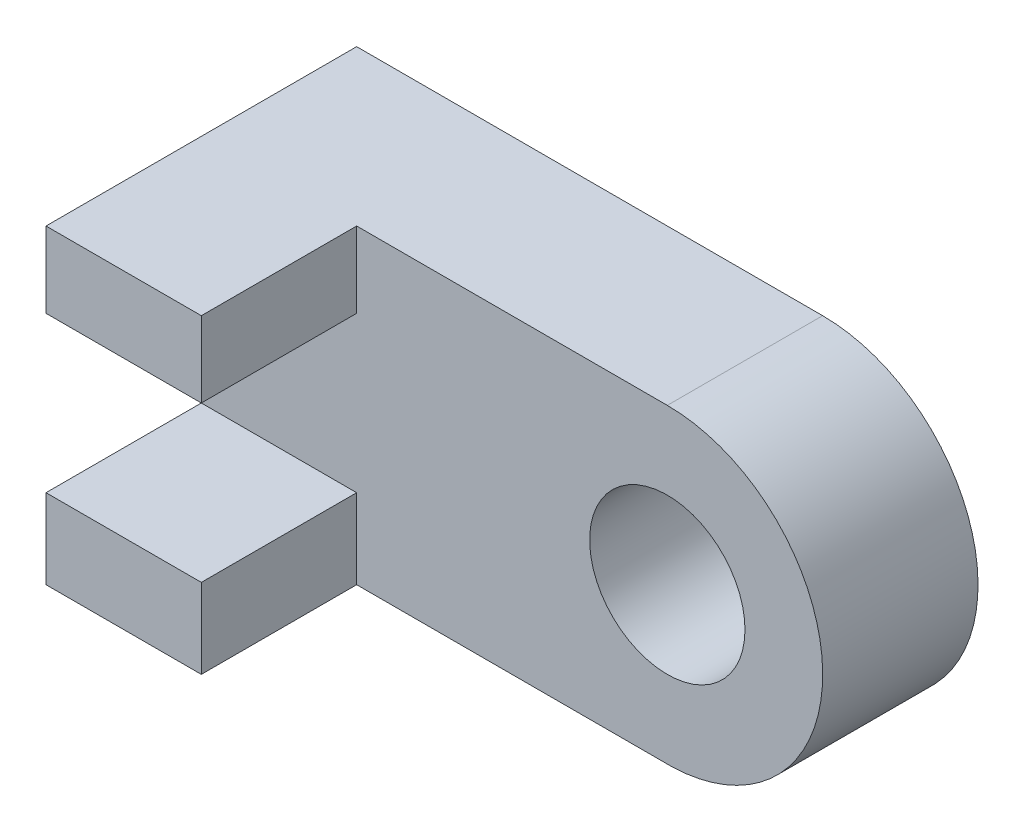
ISO-10303-21;
HEADER;
FILE_DESCRIPTION(('STEP AP214'),'2;1');
FILE_NAME('part.step','',(''),(''),'','','');
FILE_SCHEMA(('AUTOMOTIVE_DESIGN { 1 0 10303 214 1 1 1 1 }'));
ENDSEC;
DATA;
#1=APPLICATION_CONTEXT('core data for automotive mechanical design processes');
#2=APPLICATION_PROTOCOL_DEFINITION('international standard','automotive_design',2000,#1);
#3=PRODUCT_CONTEXT('',#1,'mechanical');
#4=PRODUCT('Part','Part','',(#3));
#5=PRODUCT_RELATED_PRODUCT_CATEGORY('part','',(#4));
#6=PRODUCT_DEFINITION_FORMATION('','',#4);
#7=PRODUCT_DEFINITION_CONTEXT('part definition',#1,'design');
#8=PRODUCT_DEFINITION('design','',#6,#7);
#9=PRODUCT_DEFINITION_SHAPE('','',#8);
#10=(LENGTH_UNIT() NAMED_UNIT(*) SI_UNIT(.MILLI.,.METRE.));
#11=(NAMED_UNIT(*) PLANE_ANGLE_UNIT() SI_UNIT($,.RADIAN.));
#12=(NAMED_UNIT(*) SI_UNIT($,.STERADIAN.) SOLID_ANGLE_UNIT());
#13=UNCERTAINTY_MEASURE_WITH_UNIT(LENGTH_MEASURE(1.E-05),#10,'distance_accuracy_value','');
#14=(GEOMETRIC_REPRESENTATION_CONTEXT(3) GLOBAL_UNCERTAINTY_ASSIGNED_CONTEXT((#13)) GLOBAL_UNIT_ASSIGNED_CONTEXT((#10,
#11,#12)) REPRESENTATION_CONTEXT('',''));
#15=CARTESIAN_POINT('',(0.,0.,0.));
#16=DIRECTION('',(0.,0.,1.));
#17=DIRECTION('',(1.,0.,0.));
#18=AXIS2_PLACEMENT_3D('',#15,#16,#17);
#19=CARTESIAN_POINT('',(-119.310209020902,50.1292771252762,101.6));
#20=DIRECTION('',(0.,0.,-1.));
#21=DIRECTION('',(-1.,0.,0.));
#22=AXIS2_PLACEMENT_3D('',#19,#20,#21);
#23=PLANE('',#22);
#24=DIRECTION('',(0.,1.,0.));
#25=VECTOR('',#24,1.);
#26=CARTESIAN_POINT('',(-119.310209020902,50.1292771252762,101.6));
#27=LINE('',#26,#25);
#28=CARTESIAN_POINT('',(-119.310209020902,25.3949487618513,101.6));
#29=VERTEX_POINT('',#28);
#30=CARTESIAN_POINT('',(-119.310209020902,50.1292771252762,101.6));
#31=VERTEX_POINT('',#30);
#32=EDGE_CURVE('E188',#29,#31,#27,.T.);
#33=ORIENTED_EDGE('',*,*,#32,.F.);
#34=DIRECTION('',(1.,0.,0.));
#35=VECTOR('',#34,1.);
#36=CARTESIAN_POINT('',(-119.310209020902,25.3949487618513,101.6));
#37=LINE('',#36,#35);
#38=CARTESIAN_POINT('',(-68.5102090209021,25.3949487618513,101.6));
#39=VERTEX_POINT('',#38);
#40=EDGE_CURVE('E196',#29,#39,#37,.T.);
#41=ORIENTED_EDGE('',*,*,#40,.T.);
#42=DIRECTION('',(0.,1.,0.));
#43=VECTOR('',#42,1.);
#44=CARTESIAN_POINT('',(-68.5102090209021,50.1292771252762,101.6));
#45=LINE('',#44,#43);
#46=CARTESIAN_POINT('',(-68.5102090209021,50.1292771252762,101.6));
#47=VERTEX_POINT('',#46);
#48=EDGE_CURVE('E174',#39,#47,#45,.T.);
#49=ORIENTED_EDGE('',*,*,#48,.T.);
#50=DIRECTION('',(1.,0.,0.));
#51=VECTOR('',#50,1.);
#52=CARTESIAN_POINT('',(-119.310209020902,50.1292771252762,101.6));
#53=LINE('',#52,#51);
#54=EDGE_CURVE('E165',#31,#47,#53,.T.);
#55=ORIENTED_EDGE('',*,*,#54,.F.);
#56=EDGE_LOOP('',(#33,#41,#49,#55));
#57=FACE_BOUND('',#56,.T.);
#58=ADVANCED_FACE('F27',(#57),#23,.F.);
#59=CARTESIAN_POINT('',(-68.5102090209021,50.1292771252762,0.));
#60=DIRECTION('',(-1.,0.,0.));
#61=DIRECTION('',(0.,0.,1.));
#62=AXIS2_PLACEMENT_3D('',#59,#60,#61);
#63=PLANE('',#62);
#64=ORIENTED_EDGE('',*,*,#48,.F.);
#65=DIRECTION('',(0.,0.,1.));
#66=VECTOR('',#65,1.);
#67=CARTESIAN_POINT('',(-68.5102090209021,25.3949487618513,101.6));
#68=LINE('',#67,#66);
#69=CARTESIAN_POINT('',(-68.5102090209021,25.3949487618513,50.8));
#70=VERTEX_POINT('',#69);
#71=EDGE_CURVE('E122',#70,#39,#68,.T.);
#72=ORIENTED_EDGE('',*,*,#71,.F.);
#73=DIRECTION('',(0.,-1.,0.));
#74=VECTOR('',#73,1.);
#75=CARTESIAN_POINT('',(-68.5102090209021,-51.4707228747238,50.8));
#76=LINE('',#75,#74);
#77=CARTESIAN_POINT('',(-68.5102090209021,50.1292771252762,50.8));
#78=VERTEX_POINT('',#77);
#79=EDGE_CURVE('E128',#78,#70,#76,.T.);
#80=ORIENTED_EDGE('',*,*,#79,.F.);
#81=DIRECTION('',(0.,0.,-1.));
#82=VECTOR('',#81,1.);
#83=CARTESIAN_POINT('',(-68.5102090209021,50.1292771252762,50.8));
#84=LINE('',#83,#82);
#85=EDGE_CURVE('E163',#47,#78,#84,.T.);
#86=ORIENTED_EDGE('',*,*,#85,.F.);
#87=EDGE_LOOP('',(#64,#72,#80,#86));
#88=FACE_BOUND('',#87,.T.);
#89=ADVANCED_FACE('F234',(#88),#63,.F.);
#90=CARTESIAN_POINT('',(-68.5102090209021,-51.4707228747238,50.8));
#91=DIRECTION('',(0.,1.,0.));
#92=DIRECTION('',(0.,0.,1.));
#93=AXIS2_PLACEMENT_3D('',#90,#91,#92);
#94=PLANE('',#93);
#95=DIRECTION('',(1.,0.,0.));
#96=VECTOR('',#95,1.);
#97=CARTESIAN_POINT('',(-68.5102090209021,-51.4707228747238,0.));
#98=LINE('',#97,#96);
#99=CARTESIAN_POINT('',(-119.310209020902,-51.4707228747238,0.));
#100=VERTEX_POINT('',#99);
#101=CARTESIAN_POINT('',(34.8103579147305,-51.4707228747238,0.));
#102=VERTEX_POINT('',#101);
#103=EDGE_CURVE('E139',#100,#102,#98,.T.);
#104=ORIENTED_EDGE('',*,*,#103,.T.);
#105=DIRECTION('',(0.,0.,-1.));
#106=VECTOR('',#105,1.);
#107=CARTESIAN_POINT('',(34.8103579147305,-51.4707228747238,50.8));
#108=LINE('',#107,#106);
#109=CARTESIAN_POINT('',(34.8103579147305,-51.4707228747238,50.8));
#110=VERTEX_POINT('',#109);
#111=EDGE_CURVE('E11',#110,#102,#108,.T.);
#112=ORIENTED_EDGE('',*,*,#111,.F.);
#113=DIRECTION('',(1.,0.,0.));
#114=VECTOR('',#113,1.);
#115=CARTESIAN_POINT('',(-68.5102090209021,-51.4707228747238,50.8));
#116=LINE('',#115,#114);
#117=CARTESIAN_POINT('',(-68.5102090209021,-51.4707228747238,50.8));
#118=VERTEX_POINT('',#117);
#119=EDGE_CURVE('E130',#118,#110,#116,.T.);
#120=ORIENTED_EDGE('',*,*,#119,.F.);
#121=DIRECTION('',(0.,0.,1.));
#122=VECTOR('',#121,1.);
#123=CARTESIAN_POINT('',(-68.5102090209021,-51.4707228747238,101.6));
#124=LINE('',#123,#122);
#125=CARTESIAN_POINT('',(-68.5102090209021,-51.4707228747238,101.6));
#126=VERTEX_POINT('',#125);
#127=EDGE_CURVE('E126',#118,#126,#124,.T.);
#128=ORIENTED_EDGE('',*,*,#127,.T.);
#129=DIRECTION('',(1.,0.,0.));
#130=VECTOR('',#129,1.);
#131=CARTESIAN_POINT('',(-119.310209020902,-51.4707228747238,101.6));
#132=LINE('',#131,#130);
#133=CARTESIAN_POINT('',(-119.310209020902,-51.4707228747238,101.6));
#134=VERTEX_POINT('',#133);
#135=EDGE_CURVE('E179',#134,#126,#132,.T.);
#136=ORIENTED_EDGE('',*,*,#135,.F.);
#137=DIRECTION('',(0.,0.,1.));
#138=VECTOR('',#137,1.);
#139=CARTESIAN_POINT('',(-119.310209020902,-51.4707228747238,0.));
#140=LINE('',#139,#138);
#141=EDGE_CURVE('E186',#100,#134,#140,.T.);
#142=ORIENTED_EDGE('',*,*,#141,.F.);
#143=EDGE_LOOP('',(#104,#112,#120,#128,#136,#142));
#144=FACE_BOUND('',#143,.T.);
#145=ADVANCED_FACE('F29',(#144),#94,.F.);
#146=CARTESIAN_POINT('',(33.0897909790979,-0.685291529152907,50.8));
#147=DIRECTION('',(0.,0.,-1.));
#148=DIRECTION('',(-1.,0.,0.));
#149=AXIS2_PLACEMENT_3D('',#146,#147,#148);
#150=CYLINDRICAL_SURFACE('',#149,50.8145686544291);
#151=CARTESIAN_POINT('',(33.0897909790979,-0.685291529152907,0.));
#152=DIRECTION('',(0.,0.,1.));
#153=DIRECTION('',(-1.,0.,0.));
#154=AXIS2_PLACEMENT_3D('',#151,#152,#153);
#155=CIRCLE('',#154,50.8145686544291);
#156=CARTESIAN_POINT('',(33.0897909790979,50.1292771252762,0.));
#157=VERTEX_POINT('',#156);
#158=EDGE_CURVE('E132',#102,#157,#155,.T.);
#159=ORIENTED_EDGE('',*,*,#158,.T.);
#160=DIRECTION('',(0.,0.,-1.));
#161=VECTOR('',#160,1.);
#162=CARTESIAN_POINT('',(33.0897909790979,50.1292771252762,50.8));
#163=LINE('',#162,#161);
#164=CARTESIAN_POINT('',(33.0897909790979,50.1292771252762,50.8));
#165=VERTEX_POINT('',#164);
#166=EDGE_CURVE('E37',#165,#157,#163,.T.);
#167=ORIENTED_EDGE('',*,*,#166,.F.);
#168=CARTESIAN_POINT('',(33.0897909790979,-0.685291529152907,50.8));
#169=DIRECTION('',(0.,0.,1.));
#170=DIRECTION('',(-1.,0.,0.));
#171=AXIS2_PLACEMENT_3D('',#168,#169,#170);
#172=CIRCLE('',#171,50.8145686544291);
#173=EDGE_CURVE('E53',#110,#165,#172,.T.);
#174=ORIENTED_EDGE('',*,*,#173,.F.);
#175=ORIENTED_EDGE('',*,*,#111,.T.);
#176=EDGE_LOOP('',(#159,#167,#174,#175));
#177=FACE_BOUND('',#176,.T.);
#178=ADVANCED_FACE('F158',(#177),#150,.T.);
#179=CARTESIAN_POINT('',(-68.5102090209021,50.1292771252762,50.8));
#180=DIRECTION('',(0.,-1.,0.));
#181=DIRECTION('',(0.,0.,-1.));
#182=AXIS2_PLACEMENT_3D('',#179,#180,#181);
#183=PLANE('',#182);
#184=DIRECTION('',(-1.,0.,0.));
#185=VECTOR('',#184,1.);
#186=CARTESIAN_POINT('',(-68.5102090209021,50.1292771252762,0.));
#187=LINE('',#186,#185);
#188=CARTESIAN_POINT('',(-119.310209020902,50.1292771252762,0.));
#189=VERTEX_POINT('',#188);
#190=EDGE_CURVE('E129',#157,#189,#187,.T.);
#191=ORIENTED_EDGE('',*,*,#190,.T.);
#192=DIRECTION('',(0.,0.,-1.));
#193=VECTOR('',#192,1.);
#194=CARTESIAN_POINT('',(-119.310209020902,50.1292771252762,50.8));
#195=LINE('',#194,#193);
#196=EDGE_CURVE('E168',#31,#189,#195,.T.);
#197=ORIENTED_EDGE('',*,*,#196,.F.);
#198=ORIENTED_EDGE('',*,*,#54,.T.);
#199=ORIENTED_EDGE('',*,*,#85,.T.);
#200=DIRECTION('',(-1.,0.,0.));
#201=VECTOR('',#200,1.);
#202=CARTESIAN_POINT('',(-68.5102090209021,50.1292771252762,50.8));
#203=LINE('',#202,#201);
#204=EDGE_CURVE('E150',#165,#78,#203,.T.);
#205=ORIENTED_EDGE('',*,*,#204,.F.);
#206=ORIENTED_EDGE('',*,*,#166,.T.);
#207=EDGE_LOOP('',(#191,#197,#198,#199,#205,#206));
#208=FACE_BOUND('',#207,.T.);
#209=ADVANCED_FACE('F160',(#208),#183,.F.);
#210=CARTESIAN_POINT('',(33.0897909790979,-0.685291529152907,50.8));
#211=DIRECTION('',(0.,0.,-1.));
#212=DIRECTION('',(-1.,0.,0.));
#213=AXIS2_PLACEMENT_3D('',#210,#211,#212);
#214=PLANE('',#213);
#215=CARTESIAN_POINT('',(33.0897909790979,-0.685291529152907,50.8));
#216=DIRECTION('',(0.,0.,1.));
#217=DIRECTION('',(1.,0.,0.));
#218=AXIS2_PLACEMENT_3D('',#215,#216,#217);
#219=CIRCLE('',#218,25.4);
#220=CARTESIAN_POINT('',(58.4897909790979,-0.685291529152907,50.8));
#221=VERTEX_POINT('',#220);
#222=EDGE_CURVE('E216',#221,#221,#219,.T.);
#223=ORIENTED_EDGE('',*,*,#222,.F.);
#224=EDGE_LOOP('',(#223));
#225=FACE_BOUND('',#224,.T.);
#226=ORIENTED_EDGE('',*,*,#79,.T.);
#227=DIRECTION('',(1.,0.,0.));
#228=VECTOR('',#227,1.);
#229=CARTESIAN_POINT('',(-119.310209020902,25.3949487618513,50.8));
#230=LINE('',#229,#228);
#231=CARTESIAN_POINT('',(-119.310209020902,25.3949487618513,50.8));
#232=VERTEX_POINT('',#231);
#233=EDGE_CURVE('E115',#232,#70,#230,.T.);
#234=ORIENTED_EDGE('',*,*,#233,.F.);
#235=DIRECTION('',(0.,1.,0.));
#236=VECTOR('',#235,1.);
#237=CARTESIAN_POINT('',(-119.310209020902,25.3949487618513,50.8));
#238=LINE('',#237,#236);
#239=CARTESIAN_POINT('',(-119.310209020902,-25.4050512381487,50.8));
#240=VERTEX_POINT('',#239);
#241=EDGE_CURVE('E113',#240,#232,#238,.T.);
#242=ORIENTED_EDGE('',*,*,#241,.F.);
#243=DIRECTION('',(1.,0.,0.));
#244=VECTOR('',#243,1.);
#245=CARTESIAN_POINT('',(-119.310209020902,-25.4050512381487,50.8));
#246=LINE('',#245,#244);
#247=CARTESIAN_POINT('',(-68.5102090209021,-25.4050512381487,50.8));
#248=VERTEX_POINT('',#247);
#249=EDGE_CURVE('E107',#240,#248,#246,.T.);
#250=ORIENTED_EDGE('',*,*,#249,.T.);
#251=EDGE_CURVE('E31',#248,#118,#76,.T.);
#252=ORIENTED_EDGE('',*,*,#251,.T.);
#253=ORIENTED_EDGE('',*,*,#119,.T.);
#254=ORIENTED_EDGE('',*,*,#173,.T.);
#255=ORIENTED_EDGE('',*,*,#204,.T.);
#256=EDGE_LOOP('',(#226,#234,#242,#250,#252,#253,#254,#255));
#257=FACE_BOUND('',#256,.T.);
#258=ADVANCED_FACE('F109',(#225,#257),#214,.F.);
#259=CARTESIAN_POINT('',(33.0897909790979,-0.685291529152907,0.));
#260=DIRECTION('',(0.,0.,-1.));
#261=DIRECTION('',(-1.,0.,0.));
#262=AXIS2_PLACEMENT_3D('',#259,#260,#261);
#263=PLANE('',#262);
#264=CARTESIAN_POINT('',(33.0897909790979,-0.685291529152907,0.));
#265=DIRECTION('',(0.,0.,1.));
#266=DIRECTION('',(1.,0.,0.));
#267=AXIS2_PLACEMENT_3D('',#264,#265,#266);
#268=CIRCLE('',#267,25.4);
#269=CARTESIAN_POINT('',(58.4897909790979,-0.685291529152907,0.));
#270=VERTEX_POINT('',#269);
#271=EDGE_CURVE('E123',#270,#270,#268,.T.);
#272=ORIENTED_EDGE('',*,*,#271,.T.);
#273=EDGE_LOOP('',(#272));
#274=FACE_BOUND('',#273,.T.);
#275=ORIENTED_EDGE('',*,*,#103,.F.);
#276=DIRECTION('',(0.,-1.,0.));
#277=VECTOR('',#276,1.);
#278=CARTESIAN_POINT('',(-119.310209020902,50.1292771252762,0.));
#279=LINE('',#278,#277);
#280=EDGE_CURVE('E172',#189,#100,#279,.T.);
#281=ORIENTED_EDGE('',*,*,#280,.F.);
#282=ORIENTED_EDGE('',*,*,#190,.F.);
#283=ORIENTED_EDGE('',*,*,#158,.F.);
#284=EDGE_LOOP('',(#275,#281,#282,#283));
#285=FACE_BOUND('',#284,.T.);
#286=ADVANCED_FACE('F223',(#274,#285),#263,.T.);
#287=CARTESIAN_POINT('',(-68.5102090209021,-25.4050512381487,101.6));
#288=VERTEX_POINT('',#287);
#289=EDGE_CURVE('E169',#126,#288,#45,.T.);
#290=ORIENTED_EDGE('',*,*,#289,.T.);
#291=DIRECTION('',(1.,0.,0.));
#292=VECTOR('',#291,1.);
#293=CARTESIAN_POINT('',(-119.310209020902,-25.4050512381487,101.6));
#294=LINE('',#293,#292);
#295=CARTESIAN_POINT('',(-119.310209020902,-25.4050512381487,101.6));
#296=VERTEX_POINT('',#295);
#297=EDGE_CURVE('E45',#296,#288,#294,.T.);
#298=ORIENTED_EDGE('',*,*,#297,.F.);
#299=EDGE_CURVE('E189',#134,#296,#27,.T.);
#300=ORIENTED_EDGE('',*,*,#299,.F.);
#301=ORIENTED_EDGE('',*,*,#135,.T.);
#302=EDGE_LOOP('',(#290,#298,#300,#301));
#303=FACE_BOUND('',#302,.T.);
#304=ADVANCED_FACE('F195',(#303),#23,.F.);
#305=CARTESIAN_POINT('',(-119.310209020902,50.1292771252762,0.));
#306=DIRECTION('',(-1.,0.,0.));
#307=DIRECTION('',(0.,0.,1.));
#308=AXIS2_PLACEMENT_3D('',#305,#306,#307);
#309=PLANE('',#308);
#310=DIRECTION('',(0.,0.,1.));
#311=VECTOR('',#310,1.);
#312=CARTESIAN_POINT('',(-119.310209020902,25.3949487618513,101.6));
#313=LINE('',#312,#311);
#314=EDGE_CURVE('E203',#232,#29,#313,.T.);
#315=ORIENTED_EDGE('',*,*,#314,.T.);
#316=ORIENTED_EDGE('',*,*,#32,.T.);
#317=ORIENTED_EDGE('',*,*,#196,.T.);
#318=ORIENTED_EDGE('',*,*,#280,.T.);
#319=ORIENTED_EDGE('',*,*,#141,.T.);
#320=ORIENTED_EDGE('',*,*,#299,.T.);
#321=DIRECTION('',(0.,0.,-1.));
#322=VECTOR('',#321,1.);
#323=CARTESIAN_POINT('',(-119.310209020902,-25.4050512381487,50.8));
#324=LINE('',#323,#322);
#325=EDGE_CURVE('E210',#296,#240,#324,.T.);
#326=ORIENTED_EDGE('',*,*,#325,.T.);
#327=ORIENTED_EDGE('',*,*,#241,.T.);
#328=EDGE_LOOP('',(#315,#316,#317,#318,#319,#320,#326,#327));
#329=FACE_BOUND('',#328,.T.);
#330=ADVANCED_FACE('F242',(#329),#309,.T.);
#331=ORIENTED_EDGE('',*,*,#251,.F.);
#332=DIRECTION('',(0.,0.,-1.));
#333=VECTOR('',#332,1.);
#334=CARTESIAN_POINT('',(-68.5102090209021,-25.4050512381487,50.8));
#335=LINE('',#334,#333);
#336=EDGE_CURVE('E117',#288,#248,#335,.T.);
#337=ORIENTED_EDGE('',*,*,#336,.F.);
#338=ORIENTED_EDGE('',*,*,#289,.F.);
#339=ORIENTED_EDGE('',*,*,#127,.F.);
#340=EDGE_LOOP('',(#331,#337,#338,#339));
#341=FACE_BOUND('',#340,.T.);
#342=ADVANCED_FACE('F125',(#341),#63,.F.);
#343=CARTESIAN_POINT('',(-119.310209020902,25.3949487618513,101.6));
#344=DIRECTION('',(0.,1.,0.));
#345=DIRECTION('',(0.,0.,1.));
#346=AXIS2_PLACEMENT_3D('',#343,#344,#345);
#347=PLANE('',#346);
#348=ORIENTED_EDGE('',*,*,#71,.T.);
#349=ORIENTED_EDGE('',*,*,#40,.F.);
#350=ORIENTED_EDGE('',*,*,#314,.F.);
#351=ORIENTED_EDGE('',*,*,#233,.T.);
#352=EDGE_LOOP('',(#348,#349,#350,#351));
#353=FACE_BOUND('',#352,.T.);
#354=ADVANCED_FACE('F249',(#353),#347,.F.);
#355=CARTESIAN_POINT('',(-119.310209020902,-25.4050512381487,50.8));
#356=DIRECTION('',(0.,-1.,0.));
#357=DIRECTION('',(0.,0.,-1.));
#358=AXIS2_PLACEMENT_3D('',#355,#356,#357);
#359=PLANE('',#358);
#360=ORIENTED_EDGE('',*,*,#336,.T.);
#361=ORIENTED_EDGE('',*,*,#249,.F.);
#362=ORIENTED_EDGE('',*,*,#325,.F.);
#363=ORIENTED_EDGE('',*,*,#297,.T.);
#364=EDGE_LOOP('',(#360,#361,#362,#363));
#365=FACE_BOUND('',#364,.T.);
#366=ADVANCED_FACE('F118',(#365),#359,.F.);
#367=CARTESIAN_POINT('',(33.0897909790979,-0.685291529152907,0.));
#368=DIRECTION('',(0.,0.,1.));
#369=DIRECTION('',(1.,0.,0.));
#370=AXIS2_PLACEMENT_3D('',#367,#368,#369);
#371=CYLINDRICAL_SURFACE('',#370,25.4);
#372=ORIENTED_EDGE('',*,*,#271,.F.);
#373=EDGE_LOOP('',(#372));
#374=FACE_BOUND('',#373,.T.);
#375=ORIENTED_EDGE('',*,*,#222,.T.);
#376=EDGE_LOOP('',(#375));
#377=FACE_BOUND('',#376,.T.);
#378=ADVANCED_FACE('F220',(#374,#377),#371,.F.);
#379=CLOSED_SHELL('',(#58,#89,#145,#178,#209,#258,#286,#304,#330,#342,#354,#366,#378));
#380=MANIFOLD_SOLID_BREP('B2',#379);
#381=ADVANCED_BREP_SHAPE_REPRESENTATION('',(#18,#380),#14);
#382=SHAPE_DEFINITION_REPRESENTATION(#9,#381);
ENDSEC;
END-ISO-10303-21;
